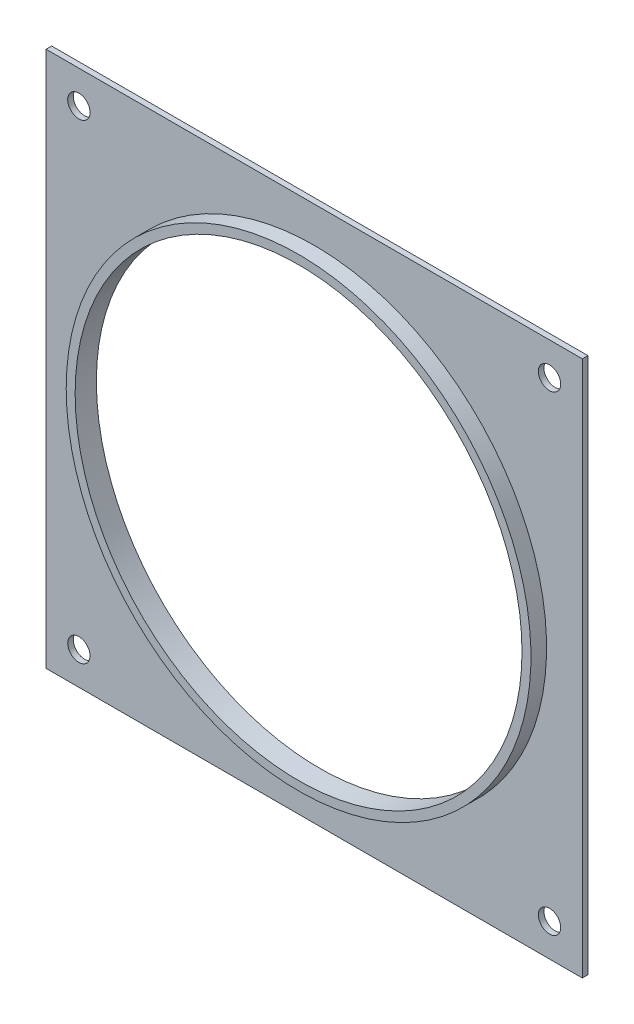
ISO-10303-21;
HEADER;
FILE_DESCRIPTION(('STEP AP214'),'2;1');
FILE_NAME('part.step','',(''),(''),'','','');
FILE_SCHEMA(('AUTOMOTIVE_DESIGN { 1 0 10303 214 1 1 1 1 }'));
ENDSEC;
DATA;
#1=APPLICATION_CONTEXT('core data for automotive mechanical design processes');
#2=APPLICATION_PROTOCOL_DEFINITION('international standard','automotive_design',2000,#1);
#3=PRODUCT_CONTEXT('',#1,'mechanical');
#4=PRODUCT('Part','Part','',(#3));
#5=PRODUCT_RELATED_PRODUCT_CATEGORY('part','',(#4));
#6=PRODUCT_DEFINITION_FORMATION('','',#4);
#7=PRODUCT_DEFINITION_CONTEXT('part definition',#1,'design');
#8=PRODUCT_DEFINITION('design','',#6,#7);
#9=PRODUCT_DEFINITION_SHAPE('','',#8);
#10=(LENGTH_UNIT() NAMED_UNIT(*) SI_UNIT(.MILLI.,.METRE.));
#11=(NAMED_UNIT(*) PLANE_ANGLE_UNIT() SI_UNIT($,.RADIAN.));
#12=(NAMED_UNIT(*) SI_UNIT($,.STERADIAN.) SOLID_ANGLE_UNIT());
#13=UNCERTAINTY_MEASURE_WITH_UNIT(LENGTH_MEASURE(1.E-05),#10,'distance_accuracy_value','');
#14=(GEOMETRIC_REPRESENTATION_CONTEXT(3) GLOBAL_UNCERTAINTY_ASSIGNED_CONTEXT((#13)) GLOBAL_UNIT_ASSIGNED_CONTEXT((#10,
#11,#12)) REPRESENTATION_CONTEXT('',''));
#15=CARTESIAN_POINT('',(0.,0.,0.));
#16=DIRECTION('',(0.,0.,1.));
#17=DIRECTION('',(1.,0.,0.));
#18=AXIS2_PLACEMENT_3D('',#15,#16,#17);
#19=CARTESIAN_POINT('',(0.,0.,1.5875));
#20=DIRECTION('',(0.,0.,-1.));
#21=DIRECTION('',(-1.,0.,0.));
#22=AXIS2_PLACEMENT_3D('',#19,#20,#21);
#23=PLANE('',#22);
#24=CARTESIAN_POINT('',(66.8782,66.8782,1.5875));
#25=DIRECTION('',(0.,0.,1.));
#26=DIRECTION('',(-1.,0.,0.));
#27=AXIS2_PLACEMENT_3D('',#24,#25,#26);
#28=CIRCLE('',#27,3.175);
#29=CARTESIAN_POINT('',(63.7032,66.8782,1.5875));
#30=VERTEX_POINT('',#29);
#31=EDGE_CURVE('E144',#30,#30,#28,.T.);
#32=ORIENTED_EDGE('',*,*,#31,.F.);
#33=EDGE_LOOP('',(#32));
#34=FACE_BOUND('',#33,.T.);
#35=CARTESIAN_POINT('',(-66.8782,66.8782,1.5875));
#36=DIRECTION('',(0.,0.,1.));
#37=DIRECTION('',(1.,0.,0.));
#38=AXIS2_PLACEMENT_3D('',#35,#36,#37);
#39=CIRCLE('',#38,3.175);
#40=CARTESIAN_POINT('',(-63.7032,66.8782,1.5875));
#41=VERTEX_POINT('',#40);
#42=EDGE_CURVE('E143',#41,#41,#39,.T.);
#43=ORIENTED_EDGE('',*,*,#42,.F.);
#44=EDGE_LOOP('',(#43));
#45=FACE_BOUND('',#44,.T.);
#46=CARTESIAN_POINT('',(-66.8782,-66.8782,1.5875));
#47=DIRECTION('',(0.,0.,1.));
#48=DIRECTION('',(-1.,0.,0.));
#49=AXIS2_PLACEMENT_3D('',#46,#47,#48);
#50=CIRCLE('',#49,3.175);
#51=CARTESIAN_POINT('',(-70.0532,-66.8782,1.5875));
#52=VERTEX_POINT('',#51);
#53=EDGE_CURVE('E150',#52,#52,#50,.T.);
#54=ORIENTED_EDGE('',*,*,#53,.F.);
#55=EDGE_LOOP('',(#54));
#56=FACE_BOUND('',#55,.T.);
#57=CARTESIAN_POINT('',(66.8782,-66.8782,1.5875));
#58=DIRECTION('',(0.,0.,1.));
#59=DIRECTION('',(1.,0.,0.));
#60=AXIS2_PLACEMENT_3D('',#57,#58,#59);
#61=CIRCLE('',#60,3.175);
#62=CARTESIAN_POINT('',(70.0532,-66.8782,1.5875));
#63=VERTEX_POINT('',#62);
#64=EDGE_CURVE('E136',#63,#63,#61,.T.);
#65=ORIENTED_EDGE('',*,*,#64,.F.);
#66=EDGE_LOOP('',(#65));
#67=FACE_BOUND('',#66,.T.);
#68=DIRECTION('',(1.,0.,0.));
#69=VECTOR('',#68,1.);
#70=CARTESIAN_POINT('',(-76.2,-76.2,1.5875));
#71=LINE('',#70,#69);
#72=CARTESIAN_POINT('',(-76.2,-76.2,1.5875));
#73=VERTEX_POINT('',#72);
#74=CARTESIAN_POINT('',(76.2,-76.2,1.5875));
#75=VERTEX_POINT('',#74);
#76=EDGE_CURVE('E92',#73,#75,#71,.T.);
#77=ORIENTED_EDGE('',*,*,#76,.T.);
#78=DIRECTION('',(0.,1.,0.));
#79=VECTOR('',#78,1.);
#80=CARTESIAN_POINT('',(76.2,76.2,1.5875));
#81=LINE('',#80,#79);
#82=CARTESIAN_POINT('',(76.2,76.2,1.5875));
#83=VERTEX_POINT('',#82);
#84=EDGE_CURVE('E87',#75,#83,#81,.T.);
#85=ORIENTED_EDGE('',*,*,#84,.T.);
#86=DIRECTION('',(-1.,0.,0.));
#87=VECTOR('',#86,1.);
#88=CARTESIAN_POINT('',(-76.2,76.2,1.5875));
#89=LINE('',#88,#87);
#90=CARTESIAN_POINT('',(-76.2,76.2,1.5875));
#91=VERTEX_POINT('',#90);
#92=EDGE_CURVE('E90',#83,#91,#89,.T.);
#93=ORIENTED_EDGE('',*,*,#92,.T.);
#94=DIRECTION('',(0.,-1.,0.));
#95=VECTOR('',#94,1.);
#96=CARTESIAN_POINT('',(-76.2,76.2,1.5875));
#97=LINE('',#96,#95);
#98=EDGE_CURVE('E56',#91,#73,#97,.T.);
#99=ORIENTED_EDGE('',*,*,#98,.T.);
#100=EDGE_LOOP('',(#77,#85,#93,#99));
#101=FACE_BOUND('',#100,.T.);
#102=CARTESIAN_POINT('',(0.,0.,1.58749999999999));
#103=DIRECTION('',(0.,0.,-1.));
#104=DIRECTION('',(-1.,0.,0.));
#105=AXIS2_PLACEMENT_3D('',#102,#103,#104);
#106=CIRCLE('',#105,66.04);
#107=CARTESIAN_POINT('',(-66.04,0.,1.58749999999999));
#108=VERTEX_POINT('',#107);
#109=EDGE_CURVE('E12',#108,#108,#106,.F.);
#110=ORIENTED_EDGE('',*,*,#109,.F.);
#111=EDGE_LOOP('',(#110));
#112=FACE_BOUND('',#111,.T.);
#113=ADVANCED_FACE('F39',(#34,#45,#56,#67,#101,#112),#23,.F.);
#114=CARTESIAN_POINT('',(0.,0.,0.));
#115=DIRECTION('',(0.,0.,-1.));
#116=DIRECTION('',(-1.,0.,0.));
#117=AXIS2_PLACEMENT_3D('',#114,#115,#116);
#118=PLANE('',#117);
#119=CARTESIAN_POINT('',(66.8782,66.8782,0.));
#120=DIRECTION('',(0.,0.,-1.));
#121=DIRECTION('',(-1.,0.,0.));
#122=AXIS2_PLACEMENT_3D('',#119,#120,#121);
#123=CIRCLE('',#122,3.175);
#124=CARTESIAN_POINT('',(63.7032,66.8782,0.));
#125=VERTEX_POINT('',#124);
#126=EDGE_CURVE('E140',#125,#125,#123,.F.);
#127=ORIENTED_EDGE('',*,*,#126,.T.);
#128=EDGE_LOOP('',(#127));
#129=FACE_BOUND('',#128,.T.);
#130=CARTESIAN_POINT('',(-66.8782,66.8782,0.));
#131=DIRECTION('',(0.,0.,-1.));
#132=DIRECTION('',(-1.,0.,0.));
#133=AXIS2_PLACEMENT_3D('',#130,#131,#132);
#134=CIRCLE('',#133,3.175);
#135=CARTESIAN_POINT('',(-70.0532,66.8782,0.));
#136=VERTEX_POINT('',#135);
#137=EDGE_CURVE('E147',#136,#136,#134,.F.);
#138=ORIENTED_EDGE('',*,*,#137,.T.);
#139=EDGE_LOOP('',(#138));
#140=FACE_BOUND('',#139,.T.);
#141=CARTESIAN_POINT('',(-66.8782,-66.8782,0.));
#142=DIRECTION('',(0.,0.,-1.));
#143=DIRECTION('',(-1.,0.,0.));
#144=AXIS2_PLACEMENT_3D('',#141,#142,#143);
#145=CIRCLE('',#144,3.175);
#146=CARTESIAN_POINT('',(-70.0532,-66.8782,0.));
#147=VERTEX_POINT('',#146);
#148=EDGE_CURVE('E139',#147,#147,#145,.F.);
#149=ORIENTED_EDGE('',*,*,#148,.T.);
#150=EDGE_LOOP('',(#149));
#151=FACE_BOUND('',#150,.T.);
#152=CARTESIAN_POINT('',(66.8782,-66.8782,0.));
#153=DIRECTION('',(0.,0.,-1.));
#154=DIRECTION('',(-1.,0.,0.));
#155=AXIS2_PLACEMENT_3D('',#152,#153,#154);
#156=CIRCLE('',#155,3.175);
#157=CARTESIAN_POINT('',(63.7032,-66.8782,0.));
#158=VERTEX_POINT('',#157);
#159=EDGE_CURVE('E133',#158,#158,#156,.F.);
#160=ORIENTED_EDGE('',*,*,#159,.T.);
#161=EDGE_LOOP('',(#160));
#162=FACE_BOUND('',#161,.T.);
#163=DIRECTION('',(1.,0.,0.));
#164=VECTOR('',#163,1.);
#165=CARTESIAN_POINT('',(-76.2,-76.2,0.));
#166=LINE('',#165,#164);
#167=CARTESIAN_POINT('',(-76.2,-76.2,0.));
#168=VERTEX_POINT('',#167);
#169=CARTESIAN_POINT('',(76.2,-76.2,0.));
#170=VERTEX_POINT('',#169);
#171=EDGE_CURVE('E106',#168,#170,#166,.T.);
#172=ORIENTED_EDGE('',*,*,#171,.F.);
#173=DIRECTION('',(0.,-1.,0.));
#174=VECTOR('',#173,1.);
#175=CARTESIAN_POINT('',(-76.2,76.2,0.));
#176=LINE('',#175,#174);
#177=CARTESIAN_POINT('',(-76.2,76.2,0.));
#178=VERTEX_POINT('',#177);
#179=EDGE_CURVE('E79',#178,#168,#176,.T.);
#180=ORIENTED_EDGE('',*,*,#179,.F.);
#181=DIRECTION('',(-1.,0.,0.));
#182=VECTOR('',#181,1.);
#183=CARTESIAN_POINT('',(-76.2,76.2,0.));
#184=LINE('',#183,#182);
#185=CARTESIAN_POINT('',(76.2,76.2,0.));
#186=VERTEX_POINT('',#185);
#187=EDGE_CURVE('E73',#186,#178,#184,.T.);
#188=ORIENTED_EDGE('',*,*,#187,.F.);
#189=DIRECTION('',(0.,1.,0.));
#190=VECTOR('',#189,1.);
#191=CARTESIAN_POINT('',(76.2,76.2,0.));
#192=LINE('',#191,#190);
#193=EDGE_CURVE('E97',#170,#186,#192,.T.);
#194=ORIENTED_EDGE('',*,*,#193,.F.);
#195=EDGE_LOOP('',(#172,#180,#188,#194));
#196=FACE_BOUND('',#195,.T.);
#197=CARTESIAN_POINT('',(0.,0.,0.));
#198=DIRECTION('',(0.,0.,1.));
#199=DIRECTION('',(1.,0.,0.));
#200=AXIS2_PLACEMENT_3D('',#197,#198,#199);
#201=CIRCLE('',#200,63.5);
#202=CARTESIAN_POINT('',(63.5,0.,0.));
#203=VERTEX_POINT('',#202);
#204=EDGE_CURVE('E109',#203,#203,#201,.T.);
#205=ORIENTED_EDGE('',*,*,#204,.T.);
#206=EDGE_LOOP('',(#205));
#207=FACE_BOUND('',#206,.T.);
#208=ADVANCED_FACE('F117',(#129,#140,#151,#162,#196,#207),#118,.T.);
#209=CARTESIAN_POINT('',(-76.2,-76.2,1.5875));
#210=DIRECTION('',(0.,1.,0.));
#211=DIRECTION('',(0.,0.,1.));
#212=AXIS2_PLACEMENT_3D('',#209,#210,#211);
#213=PLANE('',#212);
#214=ORIENTED_EDGE('',*,*,#171,.T.);
#215=DIRECTION('',(0.,0.,-1.));
#216=VECTOR('',#215,1.);
#217=CARTESIAN_POINT('',(76.2,-76.2,1.5875));
#218=LINE('',#217,#216);
#219=EDGE_CURVE('E48',#75,#170,#218,.T.);
#220=ORIENTED_EDGE('',*,*,#219,.F.);
#221=ORIENTED_EDGE('',*,*,#76,.F.);
#222=DIRECTION('',(0.,0.,-1.));
#223=VECTOR('',#222,1.);
#224=CARTESIAN_POINT('',(-76.2,-76.2,1.5875));
#225=LINE('',#224,#223);
#226=EDGE_CURVE('E102',#73,#168,#225,.T.);
#227=ORIENTED_EDGE('',*,*,#226,.T.);
#228=EDGE_LOOP('',(#214,#220,#221,#227));
#229=FACE_BOUND('',#228,.T.);
#230=ADVANCED_FACE('F41',(#229),#213,.F.);
#231=CARTESIAN_POINT('',(76.2,76.2,1.5875));
#232=DIRECTION('',(-1.,0.,0.));
#233=DIRECTION('',(0.,0.,1.));
#234=AXIS2_PLACEMENT_3D('',#231,#232,#233);
#235=PLANE('',#234);
#236=ORIENTED_EDGE('',*,*,#193,.T.);
#237=DIRECTION('',(0.,0.,-1.));
#238=VECTOR('',#237,1.);
#239=CARTESIAN_POINT('',(76.2,76.2,1.5875));
#240=LINE('',#239,#238);
#241=EDGE_CURVE('E95',#83,#186,#240,.T.);
#242=ORIENTED_EDGE('',*,*,#241,.F.);
#243=ORIENTED_EDGE('',*,*,#84,.F.);
#244=ORIENTED_EDGE('',*,*,#219,.T.);
#245=EDGE_LOOP('',(#236,#242,#243,#244));
#246=FACE_BOUND('',#245,.T.);
#247=ADVANCED_FACE('F96',(#246),#235,.F.);
#248=CARTESIAN_POINT('',(-76.2,76.2,1.5875));
#249=DIRECTION('',(0.,-1.,0.));
#250=DIRECTION('',(0.,0.,-1.));
#251=AXIS2_PLACEMENT_3D('',#248,#249,#250);
#252=PLANE('',#251);
#253=ORIENTED_EDGE('',*,*,#187,.T.);
#254=DIRECTION('',(0.,0.,-1.));
#255=VECTOR('',#254,1.);
#256=CARTESIAN_POINT('',(-76.2,76.2,1.5875));
#257=LINE('',#256,#255);
#258=EDGE_CURVE('E98',#91,#178,#257,.T.);
#259=ORIENTED_EDGE('',*,*,#258,.F.);
#260=ORIENTED_EDGE('',*,*,#92,.F.);
#261=ORIENTED_EDGE('',*,*,#241,.T.);
#262=EDGE_LOOP('',(#253,#259,#260,#261));
#263=FACE_BOUND('',#262,.T.);
#264=ADVANCED_FACE('F100',(#263),#252,.F.);
#265=CARTESIAN_POINT('',(-76.2,76.2,1.5875));
#266=DIRECTION('',(1.,0.,0.));
#267=DIRECTION('',(0.,0.,-1.));
#268=AXIS2_PLACEMENT_3D('',#265,#266,#267);
#269=PLANE('',#268);
#270=ORIENTED_EDGE('',*,*,#179,.T.);
#271=ORIENTED_EDGE('',*,*,#226,.F.);
#272=ORIENTED_EDGE('',*,*,#98,.F.);
#273=ORIENTED_EDGE('',*,*,#258,.T.);
#274=EDGE_LOOP('',(#270,#271,#272,#273));
#275=FACE_BOUND('',#274,.T.);
#276=ADVANCED_FACE('F192',(#275),#269,.F.);
#277=CARTESIAN_POINT('',(0.,0.,1.5875));
#278=DIRECTION('',(0.,0.,-1.));
#279=DIRECTION('',(-1.,0.,0.));
#280=AXIS2_PLACEMENT_3D('',#277,#278,#279);
#281=CYLINDRICAL_SURFACE('',#280,63.5);
#282=ORIENTED_EDGE('',*,*,#204,.F.);
#283=EDGE_LOOP('',(#282));
#284=FACE_BOUND('',#283,.T.);
#285=CARTESIAN_POINT('',(0.,0.,6.0325));
#286=DIRECTION('',(0.,0.,-1.));
#287=DIRECTION('',(-1.,0.,0.));
#288=AXIS2_PLACEMENT_3D('',#285,#286,#287);
#289=CIRCLE('',#288,63.5);
#290=CARTESIAN_POINT('',(-63.5,0.,6.0325));
#291=VERTEX_POINT('',#290);
#292=EDGE_CURVE('E125',#291,#291,#289,.T.);
#293=ORIENTED_EDGE('',*,*,#292,.F.);
#294=EDGE_LOOP('',(#293));
#295=FACE_BOUND('',#294,.T.);
#296=ADVANCED_FACE('F188',(#284,#295),#281,.F.);
#297=CARTESIAN_POINT('',(0.,0.,198.854327318238));
#298=DIRECTION('',(0.,0.,-1.));
#299=DIRECTION('',(-1.,0.,0.));
#300=AXIS2_PLACEMENT_3D('',#297,#298,#299);
#301=CYLINDRICAL_SURFACE('',#300,66.04);
#302=CARTESIAN_POINT('',(0.,0.,6.0325));
#303=DIRECTION('',(0.,0.,-1.));
#304=DIRECTION('',(-1.,0.,0.));
#305=AXIS2_PLACEMENT_3D('',#302,#303,#304);
#306=CIRCLE('',#305,66.04);
#307=CARTESIAN_POINT('',(-66.04,0.,6.0325));
#308=VERTEX_POINT('',#307);
#309=EDGE_CURVE('E128',#308,#308,#306,.T.);
#310=ORIENTED_EDGE('',*,*,#309,.T.);
#311=EDGE_LOOP('',(#310));
#312=FACE_BOUND('',#311,.T.);
#313=ORIENTED_EDGE('',*,*,#109,.T.);
#314=EDGE_LOOP('',(#313));
#315=FACE_BOUND('',#314,.T.);
#316=ADVANCED_FACE('F180',(#312,#315),#301,.T.);
#317=CARTESIAN_POINT('',(0.,0.,6.0325));
#318=DIRECTION('',(0.,0.,-1.));
#319=DIRECTION('',(-1.,0.,0.));
#320=AXIS2_PLACEMENT_3D('',#317,#318,#319);
#321=PLANE('',#320);
#322=ORIENTED_EDGE('',*,*,#292,.T.);
#323=EDGE_LOOP('',(#322));
#324=FACE_BOUND('',#323,.T.);
#325=ORIENTED_EDGE('',*,*,#309,.F.);
#326=EDGE_LOOP('',(#325));
#327=FACE_BOUND('',#326,.T.);
#328=ADVANCED_FACE('F170',(#324,#327),#321,.F.);
#329=CARTESIAN_POINT('',(66.8782,-66.8782,-8.98025612106915));
#330=DIRECTION('',(0.,0.,1.));
#331=DIRECTION('',(1.,0.,0.));
#332=AXIS2_PLACEMENT_3D('',#329,#330,#331);
#333=CYLINDRICAL_SURFACE('',#332,3.175);
#334=ORIENTED_EDGE('',*,*,#64,.T.);
#335=EDGE_LOOP('',(#334));
#336=FACE_BOUND('',#335,.T.);
#337=ORIENTED_EDGE('',*,*,#159,.F.);
#338=EDGE_LOOP('',(#337));
#339=FACE_BOUND('',#338,.T.);
#340=ADVANCED_FACE('F167',(#336,#339),#333,.F.);
#341=CARTESIAN_POINT('',(-66.8782,-66.8782,-8.98025612106915));
#342=DIRECTION('',(0.,0.,1.));
#343=DIRECTION('',(1.,0.,0.));
#344=AXIS2_PLACEMENT_3D('',#341,#342,#343);
#345=CYLINDRICAL_SURFACE('',#344,3.175);
#346=ORIENTED_EDGE('',*,*,#53,.T.);
#347=EDGE_LOOP('',(#346));
#348=FACE_BOUND('',#347,.T.);
#349=ORIENTED_EDGE('',*,*,#148,.F.);
#350=EDGE_LOOP('',(#349));
#351=FACE_BOUND('',#350,.T.);
#352=ADVANCED_FACE('F158',(#348,#351),#345,.F.);
#353=CARTESIAN_POINT('',(-66.8782,66.8782,-8.98025612106915));
#354=DIRECTION('',(0.,0.,1.));
#355=DIRECTION('',(1.,0.,0.));
#356=AXIS2_PLACEMENT_3D('',#353,#354,#355);
#357=CYLINDRICAL_SURFACE('',#356,3.175);
#358=ORIENTED_EDGE('',*,*,#42,.T.);
#359=EDGE_LOOP('',(#358));
#360=FACE_BOUND('',#359,.T.);
#361=ORIENTED_EDGE('',*,*,#137,.F.);
#362=EDGE_LOOP('',(#361));
#363=FACE_BOUND('',#362,.T.);
#364=ADVANCED_FACE('F178',(#360,#363),#357,.F.);
#365=CARTESIAN_POINT('',(66.8782,66.8782,-8.98025612106915));
#366=DIRECTION('',(0.,0.,1.));
#367=DIRECTION('',(1.,0.,0.));
#368=AXIS2_PLACEMENT_3D('',#365,#366,#367);
#369=CYLINDRICAL_SURFACE('',#368,3.175);
#370=ORIENTED_EDGE('',*,*,#31,.T.);
#371=EDGE_LOOP('',(#370));
#372=FACE_BOUND('',#371,.T.);
#373=ORIENTED_EDGE('',*,*,#126,.F.);
#374=EDGE_LOOP('',(#373));
#375=FACE_BOUND('',#374,.T.);
#376=ADVANCED_FACE('F185',(#372,#375),#369,.F.);
#377=CLOSED_SHELL('',(#113,#208,#230,#247,#264,#276,#296,#316,#328,#340,#352,#364,#376));
#378=MANIFOLD_SOLID_BREP('B2',#377);
#379=ADVANCED_BREP_SHAPE_REPRESENTATION('',(#18,#378),#14);
#380=SHAPE_DEFINITION_REPRESENTATION(#9,#379);
ENDSEC;
END-ISO-10303-21;
